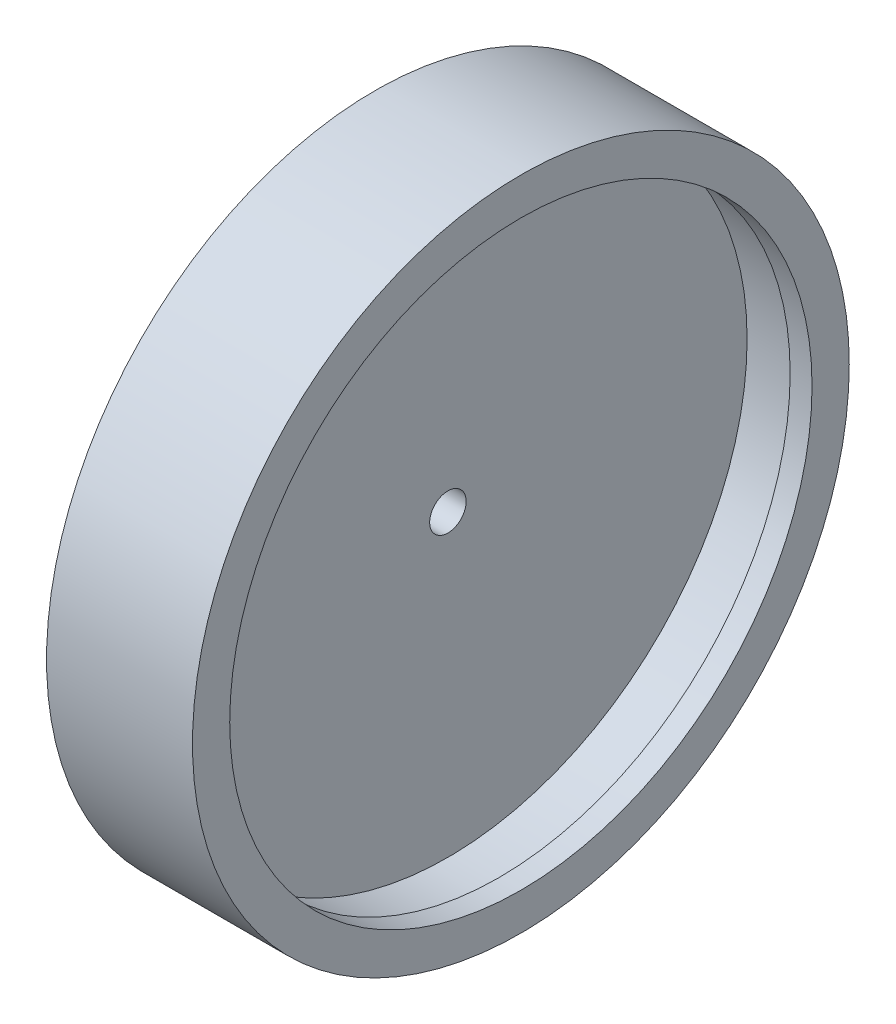
ISO-10303-21;
HEADER;
FILE_DESCRIPTION(('STEP AP214'),'2;1');
FILE_NAME('part.step','',(''),(''),'','','');
FILE_SCHEMA(('AUTOMOTIVE_DESIGN { 1 0 10303 214 1 1 1 1 }'));
ENDSEC;
DATA;
#1=APPLICATION_CONTEXT('core data for automotive mechanical design processes');
#2=APPLICATION_PROTOCOL_DEFINITION('international standard','automotive_design',2000,#1);
#3=PRODUCT_CONTEXT('',#1,'mechanical');
#4=PRODUCT('Part','Part','',(#3));
#5=PRODUCT_RELATED_PRODUCT_CATEGORY('part','',(#4));
#6=PRODUCT_DEFINITION_FORMATION('','',#4);
#7=PRODUCT_DEFINITION_CONTEXT('part definition',#1,'design');
#8=PRODUCT_DEFINITION('design','',#6,#7);
#9=PRODUCT_DEFINITION_SHAPE('','',#8);
#10=(LENGTH_UNIT() NAMED_UNIT(*) SI_UNIT(.MILLI.,.METRE.));
#11=(NAMED_UNIT(*) PLANE_ANGLE_UNIT() SI_UNIT($,.RADIAN.));
#12=(NAMED_UNIT(*) SI_UNIT($,.STERADIAN.) SOLID_ANGLE_UNIT());
#13=UNCERTAINTY_MEASURE_WITH_UNIT(LENGTH_MEASURE(1.E-05),#10,'distance_accuracy_value','');
#14=(GEOMETRIC_REPRESENTATION_CONTEXT(3) GLOBAL_UNCERTAINTY_ASSIGNED_CONTEXT((#13)) GLOBAL_UNIT_ASSIGNED_CONTEXT((#10,
#11,#12)) REPRESENTATION_CONTEXT('',''));
#15=CARTESIAN_POINT('',(0.,0.,0.));
#16=DIRECTION('',(0.,0.,1.));
#17=DIRECTION('',(1.,0.,0.));
#18=AXIS2_PLACEMENT_3D('',#15,#16,#17);
#19=CARTESIAN_POINT('',(10.,2.43915659518428,3.33406678742407));
#20=DIRECTION('',(-1.,0.,0.));
#21=DIRECTION('',(0.,0.,1.));
#22=AXIS2_PLACEMENT_3D('',#19,#20,#21);
#23=CYLINDRICAL_SURFACE('',#22,45.);
#24=CARTESIAN_POINT('',(10.,2.43915659518428,3.33406678742407));
#25=DIRECTION('',(1.,0.,0.));
#26=DIRECTION('',(0.,0.,-1.));
#27=AXIS2_PLACEMENT_3D('',#24,#25,#26);
#28=CIRCLE('',#27,45.);
#29=CARTESIAN_POINT('',(10.,2.43915659518428,-41.6659332125759));
#30=VERTEX_POINT('',#29);
#31=EDGE_CURVE('E10',#30,#30,#28,.T.);
#32=ORIENTED_EDGE('',*,*,#31,.F.);
#33=EDGE_LOOP('',(#32));
#34=FACE_BOUND('',#33,.T.);
#35=CARTESIAN_POINT('',(-10.,2.43915659518428,3.33406678742407));
#36=DIRECTION('',(1.,0.,0.));
#37=DIRECTION('',(0.,0.,-1.));
#38=AXIS2_PLACEMENT_3D('',#35,#36,#37);
#39=CIRCLE('',#38,45.);
#40=CARTESIAN_POINT('',(-10.,2.43915659518428,-41.6659332125759));
#41=VERTEX_POINT('',#40);
#42=EDGE_CURVE('E44',#41,#41,#39,.T.);
#43=ORIENTED_EDGE('',*,*,#42,.T.);
#44=EDGE_LOOP('',(#43));
#45=FACE_BOUND('',#44,.T.);
#46=ADVANCED_FACE('F33',(#34,#45),#23,.T.);
#47=CARTESIAN_POINT('',(10.,0.,0.));
#48=DIRECTION('',(1.,0.,0.));
#49=DIRECTION('',(0.,0.,-1.));
#50=AXIS2_PLACEMENT_3D('',#47,#48,#49);
#51=PLANE('',#50);
#52=ORIENTED_EDGE('',*,*,#31,.T.);
#53=EDGE_LOOP('',(#52));
#54=FACE_BOUND('',#53,.T.);
#55=CARTESIAN_POINT('',(10.,2.43915659518428,3.33406678742407));
#56=DIRECTION('',(1.,0.,0.));
#57=DIRECTION('',(0.,0.,-1.));
#58=AXIS2_PLACEMENT_3D('',#55,#56,#57);
#59=CIRCLE('',#58,39.9);
#60=CARTESIAN_POINT('',(10.,2.43915659518428,-36.5659332125759));
#61=VERTEX_POINT('',#60);
#62=EDGE_CURVE('E52',#61,#61,#59,.T.);
#63=ORIENTED_EDGE('',*,*,#62,.F.);
#64=EDGE_LOOP('',(#63));
#65=FACE_BOUND('',#64,.T.);
#66=ADVANCED_FACE('F95',(#54,#65),#51,.T.);
#67=CARTESIAN_POINT('',(-10.,2.43915659518428,3.33406678742407));
#68=DIRECTION('',(1.,0.,0.));
#69=DIRECTION('',(0.,0.,-1.));
#70=AXIS2_PLACEMENT_3D('',#67,#68,#69);
#71=PLANE('',#70);
#72=CARTESIAN_POINT('',(-10.,2.43915659518428,3.33406678742407));
#73=DIRECTION('',(1.,0.,0.));
#74=DIRECTION('',(0.,0.,-1.));
#75=AXIS2_PLACEMENT_3D('',#72,#73,#74);
#76=CIRCLE('',#75,2.5);
#77=CARTESIAN_POINT('',(-10.,2.43915659518428,0.83406678742407));
#78=VERTEX_POINT('',#77);
#79=EDGE_CURVE('E55',#78,#78,#76,.T.);
#80=ORIENTED_EDGE('',*,*,#79,.T.);
#81=EDGE_LOOP('',(#80));
#82=FACE_BOUND('',#81,.T.);
#83=ORIENTED_EDGE('',*,*,#42,.F.);
#84=EDGE_LOOP('',(#83));
#85=FACE_BOUND('',#84,.T.);
#86=ADVANCED_FACE('F64',(#82,#85),#71,.F.);
#87=CARTESIAN_POINT('',(7.,2.43915659518428,3.33406678742407));
#88=DIRECTION('',(1.,0.,0.));
#89=DIRECTION('',(0.,0.,-1.));
#90=AXIS2_PLACEMENT_3D('',#87,#88,#89);
#91=PLANE('',#90);
#92=CARTESIAN_POINT('',(7.,2.43915659518428,3.33406678742407));
#93=DIRECTION('',(1.,0.,0.));
#94=DIRECTION('',(0.,0.,-1.));
#95=AXIS2_PLACEMENT_3D('',#92,#93,#94);
#96=CIRCLE('',#95,41.);
#97=CARTESIAN_POINT('',(7.,2.43915659518428,-37.6659332125759));
#98=VERTEX_POINT('',#97);
#99=EDGE_CURVE('E48',#98,#98,#96,.T.);
#100=ORIENTED_EDGE('',*,*,#99,.F.);
#101=EDGE_LOOP('',(#100));
#102=FACE_BOUND('',#101,.T.);
#103=CARTESIAN_POINT('',(7.,2.43915659518428,3.33406678742407));
#104=DIRECTION('',(1.,0.,0.));
#105=DIRECTION('',(0.,0.,-1.));
#106=AXIS2_PLACEMENT_3D('',#103,#104,#105);
#107=CIRCLE('',#106,39.9);
#108=CARTESIAN_POINT('',(7.,2.43915659518428,-36.5659332125759));
#109=VERTEX_POINT('',#108);
#110=EDGE_CURVE('E51',#109,#109,#107,.T.);
#111=ORIENTED_EDGE('',*,*,#110,.T.);
#112=EDGE_LOOP('',(#111));
#113=FACE_BOUND('',#112,.T.);
#114=ADVANCED_FACE('F84',(#102,#113),#91,.F.);
#115=CARTESIAN_POINT('',(7.,2.43915659518428,3.33406678742407));
#116=DIRECTION('',(1.,0.,0.));
#117=DIRECTION('',(0.,0.,-1.));
#118=AXIS2_PLACEMENT_3D('',#115,#116,#117);
#119=CYLINDRICAL_SURFACE('',#118,39.9);
#120=ORIENTED_EDGE('',*,*,#110,.F.);
#121=EDGE_LOOP('',(#120));
#122=FACE_BOUND('',#121,.T.);
#123=ORIENTED_EDGE('',*,*,#62,.T.);
#124=EDGE_LOOP('',(#123));
#125=FACE_BOUND('',#124,.T.);
#126=ADVANCED_FACE('F76',(#122,#125),#119,.F.);
#127=CARTESIAN_POINT('',(0.,2.43915659518428,3.33406678742407));
#128=DIRECTION('',(1.,0.,0.));
#129=DIRECTION('',(0.,0.,-1.));
#130=AXIS2_PLACEMENT_3D('',#127,#128,#129);
#131=PLANE('',#130);
#132=CARTESIAN_POINT('',(0.,2.43915659518428,3.33406678742407));
#133=DIRECTION('',(1.,0.,0.));
#134=DIRECTION('',(0.,0.,-1.));
#135=AXIS2_PLACEMENT_3D('',#132,#133,#134);
#136=CIRCLE('',#135,2.5);
#137=CARTESIAN_POINT('',(0.,2.43915659518428,0.83406678742407));
#138=VERTEX_POINT('',#137);
#139=EDGE_CURVE('E58',#138,#138,#136,.T.);
#140=ORIENTED_EDGE('',*,*,#139,.F.);
#141=EDGE_LOOP('',(#140));
#142=FACE_BOUND('',#141,.T.);
#143=CARTESIAN_POINT('',(0.,2.43915659518428,3.33406678742407));
#144=DIRECTION('',(1.,0.,0.));
#145=DIRECTION('',(0.,0.,-1.));
#146=AXIS2_PLACEMENT_3D('',#143,#144,#145);
#147=CIRCLE('',#146,41.);
#148=CARTESIAN_POINT('',(0.,2.43915659518428,-37.6659332125759));
#149=VERTEX_POINT('',#148);
#150=EDGE_CURVE('E37',#149,#149,#147,.T.);
#151=ORIENTED_EDGE('',*,*,#150,.T.);
#152=EDGE_LOOP('',(#151));
#153=FACE_BOUND('',#152,.T.);
#154=ADVANCED_FACE('F73',(#142,#153),#131,.T.);
#155=CARTESIAN_POINT('',(10.,2.43915659518428,3.33406678742407));
#156=DIRECTION('',(-1.,0.,0.));
#157=DIRECTION('',(0.,0.,1.));
#158=AXIS2_PLACEMENT_3D('',#155,#156,#157);
#159=CYLINDRICAL_SURFACE('',#158,41.);
#160=ORIENTED_EDGE('',*,*,#150,.F.);
#161=EDGE_LOOP('',(#160));
#162=FACE_BOUND('',#161,.T.);
#163=ORIENTED_EDGE('',*,*,#99,.T.);
#164=EDGE_LOOP('',(#163));
#165=FACE_BOUND('',#164,.T.);
#166=ADVANCED_FACE('F35',(#162,#165),#159,.F.);
#167=CARTESIAN_POINT('',(-10.,2.43915659518428,3.33406678742407));
#168=DIRECTION('',(1.,0.,0.));
#169=DIRECTION('',(0.,0.,-1.));
#170=AXIS2_PLACEMENT_3D('',#167,#168,#169);
#171=CYLINDRICAL_SURFACE('',#170,2.5);
#172=ORIENTED_EDGE('',*,*,#79,.F.);
#173=EDGE_LOOP('',(#172));
#174=FACE_BOUND('',#173,.T.);
#175=ORIENTED_EDGE('',*,*,#139,.T.);
#176=EDGE_LOOP('',(#175));
#177=FACE_BOUND('',#176,.T.);
#178=ADVANCED_FACE('F67',(#174,#177),#171,.F.);
#179=CLOSED_SHELL('',(#46,#66,#86,#114,#126,#154,#166,#178));
#180=MANIFOLD_SOLID_BREP('B2',#179);
#181=ADVANCED_BREP_SHAPE_REPRESENTATION('',(#18,#180),#14);
#182=SHAPE_DEFINITION_REPRESENTATION(#9,#181);
ENDSEC;
END-ISO-10303-21;
